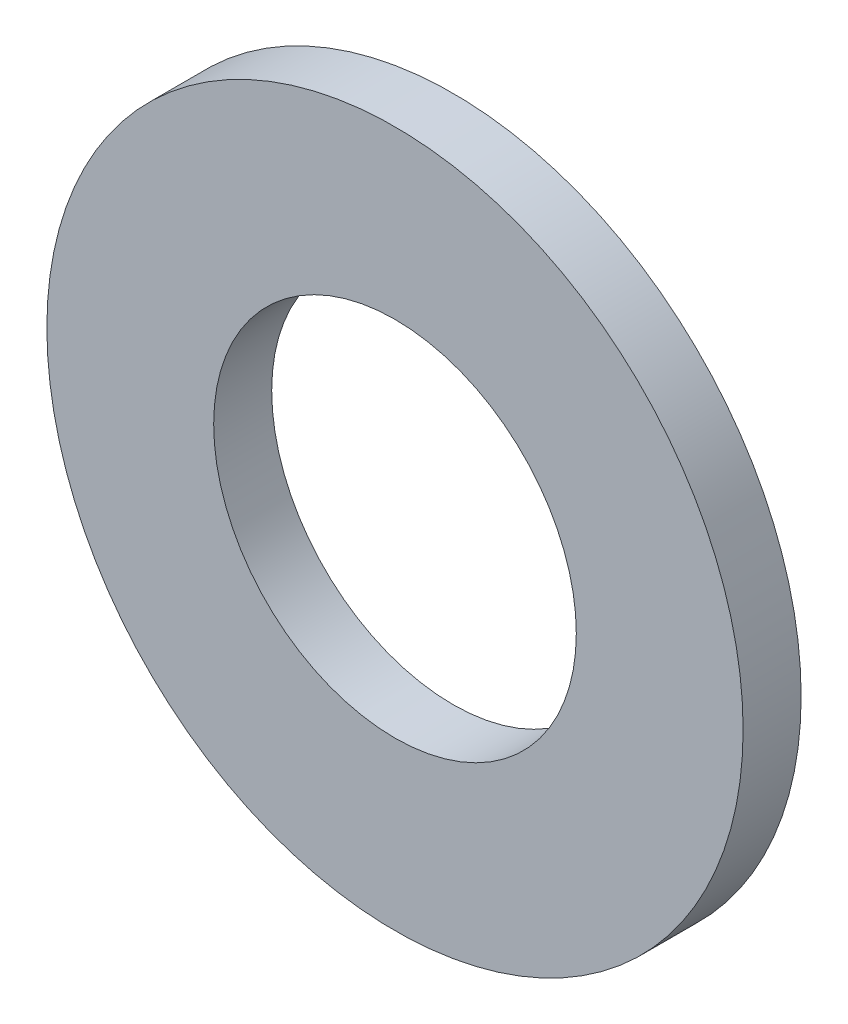
ISO-10303-21;
HEADER;
FILE_DESCRIPTION(('STEP AP214'),'2;1');
FILE_NAME('part.step','',(''),(''),'','','');
FILE_SCHEMA(('AUTOMOTIVE_DESIGN { 1 0 10303 214 1 1 1 1 }'));
ENDSEC;
DATA;
#1=APPLICATION_CONTEXT('core data for automotive mechanical design processes');
#2=APPLICATION_PROTOCOL_DEFINITION('international standard','automotive_design',2000,#1);
#3=PRODUCT_CONTEXT('',#1,'mechanical');
#4=PRODUCT('Part','Part','',(#3));
#5=PRODUCT_RELATED_PRODUCT_CATEGORY('part','',(#4));
#6=PRODUCT_DEFINITION_FORMATION('','',#4);
#7=PRODUCT_DEFINITION_CONTEXT('part definition',#1,'design');
#8=PRODUCT_DEFINITION('design','',#6,#7);
#9=PRODUCT_DEFINITION_SHAPE('','',#8);
#10=(LENGTH_UNIT() NAMED_UNIT(*) SI_UNIT(.MILLI.,.METRE.));
#11=(NAMED_UNIT(*) PLANE_ANGLE_UNIT() SI_UNIT($,.RADIAN.));
#12=(NAMED_UNIT(*) SI_UNIT($,.STERADIAN.) SOLID_ANGLE_UNIT());
#13=UNCERTAINTY_MEASURE_WITH_UNIT(LENGTH_MEASURE(1.E-05),#10,'distance_accuracy_value','');
#14=(GEOMETRIC_REPRESENTATION_CONTEXT(3) GLOBAL_UNCERTAINTY_ASSIGNED_CONTEXT((#13)) GLOBAL_UNIT_ASSIGNED_CONTEXT((#10,
#11,#12)) REPRESENTATION_CONTEXT('',''));
#15=CARTESIAN_POINT('',(0.,0.,0.));
#16=DIRECTION('',(0.,0.,1.));
#17=DIRECTION('',(1.,0.,0.));
#18=AXIS2_PLACEMENT_3D('',#15,#16,#17);
#19=CARTESIAN_POINT('',(0.,0.,1.));
#20=DIRECTION('',(0.,0.,1.));
#21=DIRECTION('',(1.,0.,0.));
#22=AXIS2_PLACEMENT_3D('',#19,#20,#21);
#23=PLANE('',#22);
#24=CARTESIAN_POINT('',(0.,0.,1.));
#25=DIRECTION('',(0.,0.,1.));
#26=DIRECTION('',(1.,0.,0.));
#27=AXIS2_PLACEMENT_3D('',#24,#25,#26);
#28=CIRCLE('',#27,6.);
#29=CARTESIAN_POINT('',(6.,0.,1.));
#30=VERTEX_POINT('',#29);
#31=EDGE_CURVE('E10',#30,#30,#28,.T.);
#32=ORIENTED_EDGE('',*,*,#31,.T.);
#33=EDGE_LOOP('',(#32));
#34=FACE_BOUND('',#33,.T.);
#35=CARTESIAN_POINT('',(0.,0.,1.));
#36=DIRECTION('',(0.,0.,1.));
#37=DIRECTION('',(1.,0.,0.));
#38=AXIS2_PLACEMENT_3D('',#35,#36,#37);
#39=CIRCLE('',#38,3.125);
#40=CARTESIAN_POINT('',(3.125,0.,1.));
#41=VERTEX_POINT('',#40);
#42=EDGE_CURVE('E55',#41,#41,#39,.T.);
#43=ORIENTED_EDGE('',*,*,#42,.F.);
#44=EDGE_LOOP('',(#43));
#45=FACE_BOUND('',#44,.T.);
#46=ADVANCED_FACE('F41',(#34,#45),#23,.T.);
#47=CARTESIAN_POINT('',(0.,0.,0.));
#48=DIRECTION('',(0.,0.,1.));
#49=DIRECTION('',(1.,0.,0.));
#50=AXIS2_PLACEMENT_3D('',#47,#48,#49);
#51=PLANE('',#50);
#52=CARTESIAN_POINT('',(0.,0.,0.));
#53=DIRECTION('',(0.,0.,1.));
#54=DIRECTION('',(1.,0.,0.));
#55=AXIS2_PLACEMENT_3D('',#52,#53,#54);
#56=CIRCLE('',#55,6.);
#57=CARTESIAN_POINT('',(6.,0.,0.));
#58=VERTEX_POINT('',#57);
#59=EDGE_CURVE('E45',#58,#58,#56,.T.);
#60=ORIENTED_EDGE('',*,*,#59,.F.);
#61=EDGE_LOOP('',(#60));
#62=FACE_BOUND('',#61,.T.);
#63=CARTESIAN_POINT('',(0.,0.,0.));
#64=DIRECTION('',(0.,0.,1.));
#65=DIRECTION('',(1.,0.,0.));
#66=AXIS2_PLACEMENT_3D('',#63,#64,#65);
#67=CIRCLE('',#66,3.125);
#68=CARTESIAN_POINT('',(3.125,0.,0.));
#69=VERTEX_POINT('',#68);
#70=EDGE_CURVE('E57',#69,#69,#67,.T.);
#71=ORIENTED_EDGE('',*,*,#70,.T.);
#72=EDGE_LOOP('',(#71));
#73=FACE_BOUND('',#72,.T.);
#74=ADVANCED_FACE('F68',(#62,#73),#51,.F.);
#75=CARTESIAN_POINT('',(0.,0.,1.));
#76=DIRECTION('',(0.,0.,-1.));
#77=DIRECTION('',(-1.,0.,0.));
#78=AXIS2_PLACEMENT_3D('',#75,#76,#77);
#79=CYLINDRICAL_SURFACE('',#78,6.);
#80=ORIENTED_EDGE('',*,*,#31,.F.);
#81=EDGE_LOOP('',(#80));
#82=FACE_BOUND('',#81,.T.);
#83=ORIENTED_EDGE('',*,*,#59,.T.);
#84=EDGE_LOOP('',(#83));
#85=FACE_BOUND('',#84,.T.);
#86=ADVANCED_FACE('F43',(#82,#85),#79,.T.);
#87=CARTESIAN_POINT('',(0.,0.,1.));
#88=DIRECTION('',(0.,0.,-1.));
#89=DIRECTION('',(-1.,0.,0.));
#90=AXIS2_PLACEMENT_3D('',#87,#88,#89);
#91=CYLINDRICAL_SURFACE('',#90,3.125);
#92=ORIENTED_EDGE('',*,*,#42,.T.);
#93=EDGE_LOOP('',(#92));
#94=FACE_BOUND('',#93,.T.);
#95=ORIENTED_EDGE('',*,*,#70,.F.);
#96=EDGE_LOOP('',(#95));
#97=FACE_BOUND('',#96,.T.);
#98=ADVANCED_FACE('F64',(#94,#97),#91,.F.);
#99=CLOSED_SHELL('',(#46,#74,#86,#98));
#100=MANIFOLD_SOLID_BREP('B2',#99);
#101=ADVANCED_BREP_SHAPE_REPRESENTATION('',(#18,#100),#14);
#102=SHAPE_DEFINITION_REPRESENTATION(#9,#101);
ENDSEC;
END-ISO-10303-21;
